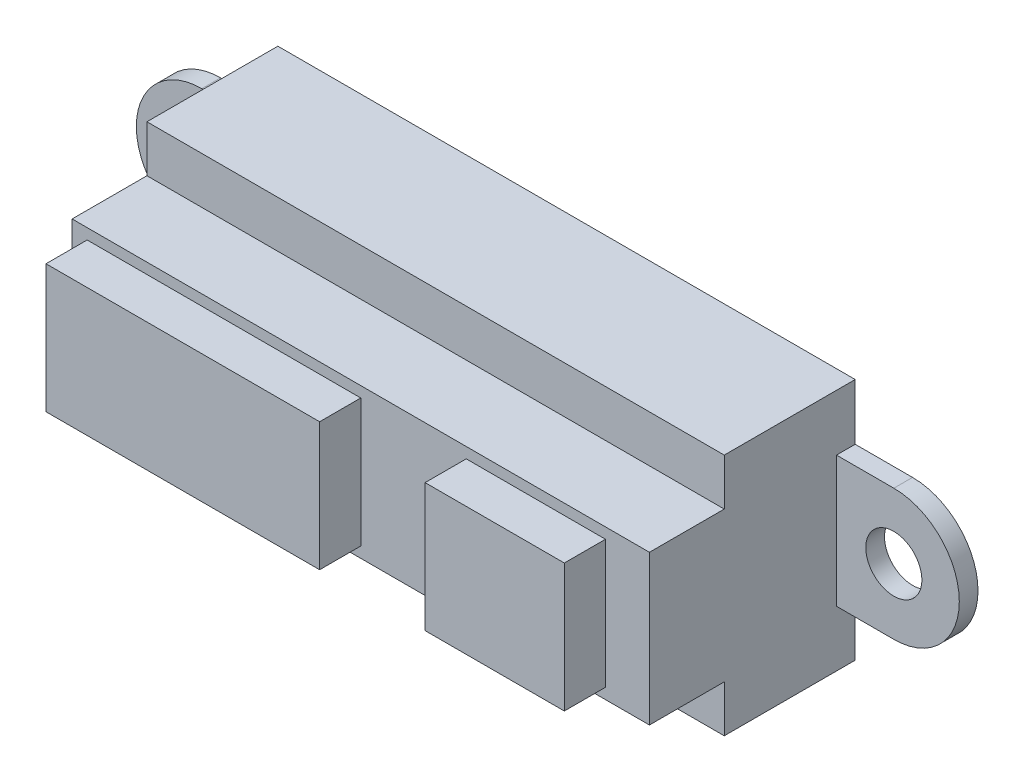
ISO-10303-21;
HEADER;
FILE_DESCRIPTION(('STEP AP214'),'2;1');
FILE_NAME('part.step','',(''),(''),'','','');
FILE_SCHEMA(('AUTOMOTIVE_DESIGN { 1 0 10303 214 1 1 1 1 }'));
ENDSEC;
DATA;
#1=APPLICATION_CONTEXT('core data for automotive mechanical design processes');
#2=APPLICATION_PROTOCOL_DEFINITION('international standard','automotive_design',2000,#1);
#3=PRODUCT_CONTEXT('',#1,'mechanical');
#4=PRODUCT('Part','Part','',(#3));
#5=PRODUCT_RELATED_PRODUCT_CATEGORY('part','',(#4));
#6=PRODUCT_DEFINITION_FORMATION('','',#4);
#7=PRODUCT_DEFINITION_CONTEXT('part definition',#1,'design');
#8=PRODUCT_DEFINITION('design','',#6,#7);
#9=PRODUCT_DEFINITION_SHAPE('','',#8);
#10=(LENGTH_UNIT() NAMED_UNIT(*) SI_UNIT(.MILLI.,.METRE.));
#11=(NAMED_UNIT(*) PLANE_ANGLE_UNIT() SI_UNIT($,.RADIAN.));
#12=(NAMED_UNIT(*) SI_UNIT($,.STERADIAN.) SOLID_ANGLE_UNIT());
#13=UNCERTAINTY_MEASURE_WITH_UNIT(LENGTH_MEASURE(1.E-05),#10,'distance_accuracy_value','');
#14=(GEOMETRIC_REPRESENTATION_CONTEXT(3) GLOBAL_UNCERTAINTY_ASSIGNED_CONTEXT((#13)) GLOBAL_UNIT_ASSIGNED_CONTEXT((#10,
#11,#12)) REPRESENTATION_CONTEXT('',''));
#15=CARTESIAN_POINT('',(0.,0.,0.));
#16=DIRECTION('',(0.,0.,1.));
#17=DIRECTION('',(1.,0.,0.));
#18=AXIS2_PLACEMENT_3D('',#15,#16,#17);
#19=CARTESIAN_POINT('',(0.,0.,11.));
#20=DIRECTION('',(0.,0.,1.));
#21=DIRECTION('',(1.,0.,0.));
#22=AXIS2_PLACEMENT_3D('',#19,#20,#21);
#23=PLANE('',#22);
#24=DIRECTION('',(0.,-1.,0.));
#25=VECTOR('',#24,1.);
#26=CARTESIAN_POINT('',(-15.4334998563258,4.,11.));
#27=LINE('',#26,#25);
#28=CARTESIAN_POINT('',(-15.4334998563258,4.,11.));
#29=VERTEX_POINT('',#28);
#30=CARTESIAN_POINT('',(-15.4334998563258,-4.,11.));
#31=VERTEX_POINT('',#30);
#32=EDGE_CURVE('E290',#29,#31,#27,.T.);
#33=ORIENTED_EDGE('',*,*,#32,.T.);
#34=DIRECTION('',(1.,0.,0.));
#35=VECTOR('',#34,1.);
#36=CARTESIAN_POINT('',(-15.4334998563258,-4.,11.));
#37=LINE('',#36,#35);
#38=CARTESIAN_POINT('',(15.4334998563258,-4.,11.));
#39=VERTEX_POINT('',#38);
#40=EDGE_CURVE('E293',#31,#39,#37,.T.);
#41=ORIENTED_EDGE('',*,*,#40,.T.);
#42=DIRECTION('',(0.,1.,0.));
#43=VECTOR('',#42,1.);
#44=CARTESIAN_POINT('',(15.4334998563258,4.,11.));
#45=LINE('',#44,#43);
#46=CARTESIAN_POINT('',(15.4334998563258,4.,11.));
#47=VERTEX_POINT('',#46);
#48=EDGE_CURVE('E295',#39,#47,#45,.T.);
#49=ORIENTED_EDGE('',*,*,#48,.T.);
#50=DIRECTION('',(-1.,0.,0.));
#51=VECTOR('',#50,1.);
#52=CARTESIAN_POINT('',(-15.4334998563258,4.,11.));
#53=LINE('',#52,#51);
#54=EDGE_CURVE('E297',#47,#29,#53,.T.);
#55=ORIENTED_EDGE('',*,*,#54,.T.);
#56=EDGE_LOOP('',(#33,#41,#49,#55));
#57=FACE_BOUND('',#56,.T.);
#58=DIRECTION('',(-1.,0.,0.));
#59=VECTOR('',#58,1.);
#60=CARTESIAN_POINT('',(0.,-3.42720985348212,11.));
#61=LINE('',#60,#59);
#62=CARTESIAN_POINT('',(0.,-3.42720985348212,11.));
#63=VERTEX_POINT('',#62);
#64=CARTESIAN_POINT('',(-14.6301323852945,-3.42720985348212,11.));
#65=VERTEX_POINT('',#64);
#66=EDGE_CURVE('E44',#63,#65,#61,.T.);
#67=ORIENTED_EDGE('',*,*,#66,.T.);
#68=DIRECTION('',(0.,1.,0.));
#69=VECTOR('',#68,1.);
#70=CARTESIAN_POINT('',(-14.6301323852945,0.,11.));
#71=LINE('',#70,#69);
#72=CARTESIAN_POINT('',(-14.6301323852945,3.42720985348204,11.));
#73=VERTEX_POINT('',#72);
#74=EDGE_CURVE('E11',#65,#73,#71,.T.);
#75=ORIENTED_EDGE('',*,*,#74,.T.);
#76=DIRECTION('',(1.,0.,0.));
#77=VECTOR('',#76,1.);
#78=CARTESIAN_POINT('',(0.,3.42720985348204,11.));
#79=LINE('',#78,#77);
#80=CARTESIAN_POINT('',(0.,3.42720985348204,11.));
#81=VERTEX_POINT('',#80);
#82=EDGE_CURVE('E378',#73,#81,#79,.T.);
#83=ORIENTED_EDGE('',*,*,#82,.T.);
#84=DIRECTION('',(0.,-1.,0.));
#85=VECTOR('',#84,1.);
#86=CARTESIAN_POINT('',(0.,0.,11.));
#87=LINE('',#86,#85);
#88=EDGE_CURVE('E381',#81,#63,#87,.T.);
#89=ORIENTED_EDGE('',*,*,#88,.T.);
#90=EDGE_LOOP('',(#67,#75,#83,#89));
#91=FACE_BOUND('',#90,.T.);
#92=DIRECTION('',(-1.,0.,0.));
#93=VECTOR('',#92,1.);
#94=CARTESIAN_POINT('',(0.,-3.42720985348212,11.));
#95=LINE('',#94,#93);
#96=CARTESIAN_POINT('',(13.0823601933993,-3.42720985348212,11.));
#97=VERTEX_POINT('',#96);
#98=CARTESIAN_POINT('',(5.63831298476084,-3.42720985348212,11.));
#99=VERTEX_POINT('',#98);
#100=EDGE_CURVE('E265',#97,#99,#95,.T.);
#101=ORIENTED_EDGE('',*,*,#100,.T.);
#102=DIRECTION('',(0.,1.,0.));
#103=VECTOR('',#102,1.);
#104=CARTESIAN_POINT('',(5.63831298476084,0.,11.));
#105=LINE('',#104,#103);
#106=CARTESIAN_POINT('',(5.63831298476084,3.42720985348204,11.));
#107=VERTEX_POINT('',#106);
#108=EDGE_CURVE('E268',#99,#107,#105,.T.);
#109=ORIENTED_EDGE('',*,*,#108,.T.);
#110=DIRECTION('',(1.,0.,0.));
#111=VECTOR('',#110,1.);
#112=CARTESIAN_POINT('',(0.,3.42720985348204,11.));
#113=LINE('',#112,#111);
#114=CARTESIAN_POINT('',(13.0823601933993,3.42720985348204,11.));
#115=VERTEX_POINT('',#114);
#116=EDGE_CURVE('E259',#107,#115,#113,.T.);
#117=ORIENTED_EDGE('',*,*,#116,.T.);
#118=DIRECTION('',(0.,-1.,0.));
#119=VECTOR('',#118,1.);
#120=CARTESIAN_POINT('',(13.0823601933993,0.,11.));
#121=LINE('',#120,#119);
#122=EDGE_CURVE('E262',#115,#97,#121,.T.);
#123=ORIENTED_EDGE('',*,*,#122,.T.);
#124=EDGE_LOOP('',(#101,#109,#117,#123));
#125=FACE_BOUND('',#124,.T.);
#126=ADVANCED_FACE('F35',(#57,#91,#125),#23,.T.);
#127=CARTESIAN_POINT('',(0.,0.,7.));
#128=DIRECTION('',(0.,0.,-1.));
#129=DIRECTION('',(-1.,0.,0.));
#130=AXIS2_PLACEMENT_3D('',#127,#128,#129);
#131=PLANE('',#130);
#132=DIRECTION('',(1.,0.,0.));
#133=VECTOR('',#132,1.);
#134=CARTESIAN_POINT('',(0.,-4.,7.));
#135=LINE('',#134,#133);
#136=CARTESIAN_POINT('',(-15.4334998563258,-4.,7.));
#137=VERTEX_POINT('',#136);
#138=CARTESIAN_POINT('',(15.4334998563258,-4.,7.));
#139=VERTEX_POINT('',#138);
#140=EDGE_CURVE('E375',#137,#139,#135,.T.);
#141=ORIENTED_EDGE('',*,*,#140,.F.);
#142=DIRECTION('',(0.,-1.,0.));
#143=VECTOR('',#142,1.);
#144=CARTESIAN_POINT('',(-15.4334998563258,6.5,7.));
#145=LINE('',#144,#143);
#146=CARTESIAN_POINT('',(-15.4334998563258,-6.5,7.));
#147=VERTEX_POINT('',#146);
#148=EDGE_CURVE('E315',#137,#147,#145,.T.);
#149=ORIENTED_EDGE('',*,*,#148,.T.);
#150=DIRECTION('',(1.,0.,0.));
#151=VECTOR('',#150,1.);
#152=CARTESIAN_POINT('',(-15.4334998563258,-6.5,7.));
#153=LINE('',#152,#151);
#154=CARTESIAN_POINT('',(15.4334998563258,-6.5,7.));
#155=VERTEX_POINT('',#154);
#156=EDGE_CURVE('E319',#147,#155,#153,.T.);
#157=ORIENTED_EDGE('',*,*,#156,.T.);
#158=DIRECTION('',(0.,1.,0.));
#159=VECTOR('',#158,1.);
#160=CARTESIAN_POINT('',(15.4334998563258,6.5,7.));
#161=LINE('',#160,#159);
#162=EDGE_CURVE('E322',#155,#139,#161,.T.);
#163=ORIENTED_EDGE('',*,*,#162,.T.);
#164=EDGE_LOOP('',(#141,#149,#157,#163));
#165=FACE_BOUND('',#164,.T.);
#166=ADVANCED_FACE('F461',(#165),#131,.F.);
#167=DIRECTION('',(-1.,0.,0.));
#168=VECTOR('',#167,1.);
#169=CARTESIAN_POINT('',(0.,4.,7.));
#170=LINE('',#169,#168);
#171=CARTESIAN_POINT('',(15.4334998563258,4.,7.));
#172=VERTEX_POINT('',#171);
#173=CARTESIAN_POINT('',(-15.4334998563258,4.,7.));
#174=VERTEX_POINT('',#173);
#175=EDGE_CURVE('E210',#172,#174,#170,.T.);
#176=ORIENTED_EDGE('',*,*,#175,.F.);
#177=CARTESIAN_POINT('',(15.4334998563258,6.5,7.));
#178=VERTEX_POINT('',#177);
#179=EDGE_CURVE('E321',#172,#178,#161,.T.);
#180=ORIENTED_EDGE('',*,*,#179,.T.);
#181=DIRECTION('',(-1.,0.,0.));
#182=VECTOR('',#181,1.);
#183=CARTESIAN_POINT('',(-15.4334998563258,6.5,7.));
#184=LINE('',#183,#182);
#185=CARTESIAN_POINT('',(-15.4334998563258,6.5,7.));
#186=VERTEX_POINT('',#185);
#187=EDGE_CURVE('E312',#178,#186,#184,.T.);
#188=ORIENTED_EDGE('',*,*,#187,.T.);
#189=EDGE_CURVE('E317',#186,#174,#145,.T.);
#190=ORIENTED_EDGE('',*,*,#189,.T.);
#191=EDGE_LOOP('',(#176,#180,#188,#190));
#192=FACE_BOUND('',#191,.T.);
#193=ADVANCED_FACE('F459',(#192),#131,.F.);
#194=CARTESIAN_POINT('',(-18.5,-3.5,1.));
#195=DIRECTION('',(0.,1.,0.));
#196=DIRECTION('',(0.,0.,1.));
#197=AXIS2_PLACEMENT_3D('',#194,#195,#196);
#198=PLANE('',#197);
#199=DIRECTION('',(0.,0.,-1.));
#200=VECTOR('',#199,1.);
#201=CARTESIAN_POINT('',(-15.4334998563258,-3.5,1.));
#202=LINE('',#201,#200);
#203=CARTESIAN_POINT('',(-15.4334998563258,-3.5,1.));
#204=VERTEX_POINT('',#203);
#205=CARTESIAN_POINT('',(-15.4334998563258,-3.49999999999999,0.));
#206=VERTEX_POINT('',#205);
#207=EDGE_CURVE('E356',#204,#206,#202,.T.);
#208=ORIENTED_EDGE('',*,*,#207,.F.);
#209=DIRECTION('',(1.,0.,0.));
#210=VECTOR('',#209,1.);
#211=CARTESIAN_POINT('',(-18.5,-3.5,1.));
#212=LINE('',#211,#210);
#213=CARTESIAN_POINT('',(-18.5,-3.5,1.));
#214=VERTEX_POINT('',#213);
#215=EDGE_CURVE('E205',#214,#204,#212,.T.);
#216=ORIENTED_EDGE('',*,*,#215,.F.);
#217=DIRECTION('',(0.,0.,-1.));
#218=VECTOR('',#217,1.);
#219=CARTESIAN_POINT('',(-18.5,-3.5,1.));
#220=LINE('',#219,#218);
#221=CARTESIAN_POINT('',(-18.5,-3.5,0.));
#222=VERTEX_POINT('',#221);
#223=EDGE_CURVE('E200',#214,#222,#220,.T.);
#224=ORIENTED_EDGE('',*,*,#223,.T.);
#225=DIRECTION('',(1.,0.,0.));
#226=VECTOR('',#225,1.);
#227=CARTESIAN_POINT('',(-18.5,-3.5,0.));
#228=LINE('',#227,#226);
#229=EDGE_CURVE('E203',#222,#206,#228,.T.);
#230=ORIENTED_EDGE('',*,*,#229,.T.);
#231=EDGE_LOOP('',(#208,#216,#224,#230));
#232=FACE_BOUND('',#231,.T.);
#233=ADVANCED_FACE('F37',(#232),#198,.F.);
#234=DIRECTION('',(0.,0.,1.));
#235=VECTOR('',#234,1.);
#236=CARTESIAN_POINT('',(15.4334998563258,-3.5,1.));
#237=LINE('',#236,#235);
#238=CARTESIAN_POINT('',(15.4334998563258,-3.49999999999999,0.));
#239=VERTEX_POINT('',#238);
#240=CARTESIAN_POINT('',(15.4334998563258,-3.5,1.));
#241=VERTEX_POINT('',#240);
#242=EDGE_CURVE('E348',#239,#241,#237,.T.);
#243=ORIENTED_EDGE('',*,*,#242,.F.);
#244=CARTESIAN_POINT('',(18.5,-3.5,0.));
#245=VERTEX_POINT('',#244);
#246=EDGE_CURVE('E222',#239,#245,#228,.T.);
#247=ORIENTED_EDGE('',*,*,#246,.T.);
#248=DIRECTION('',(0.,0.,-1.));
#249=VECTOR('',#248,1.);
#250=CARTESIAN_POINT('',(18.5,-3.5,1.));
#251=LINE('',#250,#249);
#252=CARTESIAN_POINT('',(18.5,-3.5,1.));
#253=VERTEX_POINT('',#252);
#254=EDGE_CURVE('E211',#253,#245,#251,.T.);
#255=ORIENTED_EDGE('',*,*,#254,.F.);
#256=EDGE_CURVE('E360',#241,#253,#212,.T.);
#257=ORIENTED_EDGE('',*,*,#256,.F.);
#258=EDGE_LOOP('',(#243,#247,#255,#257));
#259=FACE_BOUND('',#258,.T.);
#260=ADVANCED_FACE('F436',(#259),#198,.F.);
#261=CARTESIAN_POINT('',(-18.5,3.5,1.));
#262=DIRECTION('',(0.,-1.,0.));
#263=DIRECTION('',(0.,0.,-1.));
#264=AXIS2_PLACEMENT_3D('',#261,#262,#263);
#265=PLANE('',#264);
#266=DIRECTION('',(0.,0.,1.));
#267=VECTOR('',#266,1.);
#268=CARTESIAN_POINT('',(-15.4334998563258,3.5,1.));
#269=LINE('',#268,#267);
#270=CARTESIAN_POINT('',(-15.4334998563258,3.5,0.));
#271=VERTEX_POINT('',#270);
#272=CARTESIAN_POINT('',(-15.4334998563258,3.5,1.));
#273=VERTEX_POINT('',#272);
#274=EDGE_CURVE('E353',#271,#273,#269,.T.);
#275=ORIENTED_EDGE('',*,*,#274,.F.);
#276=DIRECTION('',(-1.,0.,0.));
#277=VECTOR('',#276,1.);
#278=CARTESIAN_POINT('',(-18.5,3.5,0.));
#279=LINE('',#278,#277);
#280=CARTESIAN_POINT('',(-18.5,3.5,0.));
#281=VERTEX_POINT('',#280);
#282=EDGE_CURVE('E221',#271,#281,#279,.T.);
#283=ORIENTED_EDGE('',*,*,#282,.T.);
#284=DIRECTION('',(0.,0.,-1.));
#285=VECTOR('',#284,1.);
#286=CARTESIAN_POINT('',(-18.5,3.5,1.));
#287=LINE('',#286,#285);
#288=CARTESIAN_POINT('',(-18.5,3.5,1.));
#289=VERTEX_POINT('',#288);
#290=EDGE_CURVE('E227',#289,#281,#287,.T.);
#291=ORIENTED_EDGE('',*,*,#290,.F.);
#292=DIRECTION('',(-1.,0.,0.));
#293=VECTOR('',#292,1.);
#294=CARTESIAN_POINT('',(-18.5,3.5,1.));
#295=LINE('',#294,#293);
#296=EDGE_CURVE('E359',#273,#289,#295,.T.);
#297=ORIENTED_EDGE('',*,*,#296,.F.);
#298=EDGE_LOOP('',(#275,#283,#291,#297));
#299=FACE_BOUND('',#298,.T.);
#300=ADVANCED_FACE('F412',(#299),#265,.F.);
#301=DIRECTION('',(0.,0.,-1.));
#302=VECTOR('',#301,1.);
#303=CARTESIAN_POINT('',(15.4334998563258,3.5,1.));
#304=LINE('',#303,#302);
#305=CARTESIAN_POINT('',(15.4334998563258,3.5,1.));
#306=VERTEX_POINT('',#305);
#307=CARTESIAN_POINT('',(15.4334998563258,3.5,0.));
#308=VERTEX_POINT('',#307);
#309=EDGE_CURVE('E346',#306,#308,#304,.T.);
#310=ORIENTED_EDGE('',*,*,#309,.F.);
#311=CARTESIAN_POINT('',(18.5,3.5,1.));
#312=VERTEX_POINT('',#311);
#313=EDGE_CURVE('E361',#312,#306,#295,.T.);
#314=ORIENTED_EDGE('',*,*,#313,.F.);
#315=DIRECTION('',(0.,0.,-1.));
#316=VECTOR('',#315,1.);
#317=CARTESIAN_POINT('',(18.5,3.5,1.));
#318=LINE('',#317,#316);
#319=CARTESIAN_POINT('',(18.5,3.5,0.));
#320=VERTEX_POINT('',#319);
#321=EDGE_CURVE('E368',#312,#320,#318,.T.);
#322=ORIENTED_EDGE('',*,*,#321,.T.);
#323=EDGE_CURVE('E364',#320,#308,#279,.T.);
#324=ORIENTED_EDGE('',*,*,#323,.T.);
#325=EDGE_LOOP('',(#310,#314,#322,#324));
#326=FACE_BOUND('',#325,.T.);
#327=ADVANCED_FACE('F405',(#326),#265,.F.);
#328=CARTESIAN_POINT('',(0.,0.,1.));
#329=DIRECTION('',(0.,0.,1.));
#330=DIRECTION('',(1.,0.,0.));
#331=AXIS2_PLACEMENT_3D('',#328,#329,#330);
#332=PLANE('',#331);
#333=CARTESIAN_POINT('',(-18.5,0.,1.));
#334=DIRECTION('',(0.,0.,1.));
#335=DIRECTION('',(1.,0.,0.));
#336=AXIS2_PLACEMENT_3D('',#333,#334,#335);
#337=CIRCLE('',#336,1.5);
#338=CARTESIAN_POINT('',(-17.,0.,1.));
#339=VERTEX_POINT('',#338);
#340=EDGE_CURVE('E393',#339,#339,#337,.T.);
#341=ORIENTED_EDGE('',*,*,#340,.F.);
#342=EDGE_LOOP('',(#341));
#343=FACE_BOUND('',#342,.T.);
#344=DIRECTION('',(0.,1.,0.));
#345=VECTOR('',#344,1.);
#346=CARTESIAN_POINT('',(-15.4334998563258,0.,1.));
#347=LINE('',#346,#345);
#348=EDGE_CURVE('E351',#204,#273,#347,.T.);
#349=ORIENTED_EDGE('',*,*,#348,.T.);
#350=ORIENTED_EDGE('',*,*,#296,.T.);
#351=CARTESIAN_POINT('',(-18.5,0.,1.));
#352=DIRECTION('',(0.,0.,1.));
#353=DIRECTION('',(1.,0.,0.));
#354=AXIS2_PLACEMENT_3D('',#351,#352,#353);
#355=CIRCLE('',#354,3.5);
#356=EDGE_CURVE('E229',#289,#214,#355,.T.);
#357=ORIENTED_EDGE('',*,*,#356,.T.);
#358=ORIENTED_EDGE('',*,*,#215,.T.);
#359=EDGE_LOOP('',(#349,#350,#357,#358));
#360=FACE_BOUND('',#359,.T.);
#361=ADVANCED_FACE('F401',(#343,#360),#332,.T.);
#362=CARTESIAN_POINT('',(18.5,0.,1.));
#363=DIRECTION('',(0.,0.,1.));
#364=DIRECTION('',(1.,0.,0.));
#365=AXIS2_PLACEMENT_3D('',#362,#363,#364);
#366=CIRCLE('',#365,1.5);
#367=CARTESIAN_POINT('',(20.,0.,1.));
#368=VERTEX_POINT('',#367);
#369=EDGE_CURVE('E386',#368,#368,#366,.T.);
#370=ORIENTED_EDGE('',*,*,#369,.F.);
#371=EDGE_LOOP('',(#370));
#372=FACE_BOUND('',#371,.T.);
#373=ORIENTED_EDGE('',*,*,#256,.T.);
#374=CARTESIAN_POINT('',(18.5,0.,1.));
#375=DIRECTION('',(0.,0.,1.));
#376=DIRECTION('',(1.,0.,0.));
#377=AXIS2_PLACEMENT_3D('',#374,#375,#376);
#378=CIRCLE('',#377,3.5);
#379=EDGE_CURVE('E228',#253,#312,#378,.T.);
#380=ORIENTED_EDGE('',*,*,#379,.T.);
#381=ORIENTED_EDGE('',*,*,#313,.T.);
#382=DIRECTION('',(0.,-1.,0.));
#383=VECTOR('',#382,1.);
#384=CARTESIAN_POINT('',(15.4334998563258,0.,1.));
#385=LINE('',#384,#383);
#386=EDGE_CURVE('E344',#306,#241,#385,.T.);
#387=ORIENTED_EDGE('',*,*,#386,.T.);
#388=EDGE_LOOP('',(#373,#380,#381,#387));
#389=FACE_BOUND('',#388,.T.);
#390=ADVANCED_FACE('F404',(#372,#389),#332,.T.);
#391=CARTESIAN_POINT('',(0.,0.,0.));
#392=DIRECTION('',(0.,0.,1.));
#393=DIRECTION('',(1.,0.,0.));
#394=AXIS2_PLACEMENT_3D('',#391,#392,#393);
#395=PLANE('',#394);
#396=CARTESIAN_POINT('',(-18.5,0.,0.));
#397=DIRECTION('',(0.,0.,1.));
#398=DIRECTION('',(1.,0.,0.));
#399=AXIS2_PLACEMENT_3D('',#396,#397,#398);
#400=CIRCLE('',#399,1.5);
#401=CARTESIAN_POINT('',(-17.,0.,0.));
#402=VERTEX_POINT('',#401);
#403=EDGE_CURVE('E39',#402,#402,#400,.T.);
#404=ORIENTED_EDGE('',*,*,#403,.T.);
#405=EDGE_LOOP('',(#404));
#406=FACE_BOUND('',#405,.T.);
#407=CARTESIAN_POINT('',(18.5,0.,0.));
#408=DIRECTION('',(0.,0.,1.));
#409=DIRECTION('',(1.,0.,0.));
#410=AXIS2_PLACEMENT_3D('',#407,#408,#409);
#411=CIRCLE('',#410,1.5);
#412=CARTESIAN_POINT('',(20.,0.,0.));
#413=VERTEX_POINT('',#412);
#414=EDGE_CURVE('E234',#413,#413,#411,.T.);
#415=ORIENTED_EDGE('',*,*,#414,.T.);
#416=EDGE_LOOP('',(#415));
#417=FACE_BOUND('',#416,.T.);
#418=ORIENTED_EDGE('',*,*,#229,.F.);
#419=CARTESIAN_POINT('',(-18.5,0.,0.));
#420=DIRECTION('',(0.,0.,1.));
#421=DIRECTION('',(1.,0.,0.));
#422=AXIS2_PLACEMENT_3D('',#419,#420,#421);
#423=CIRCLE('',#422,3.5);
#424=EDGE_CURVE('E218',#222,#281,#423,.F.);
#425=ORIENTED_EDGE('',*,*,#424,.T.);
#426=ORIENTED_EDGE('',*,*,#282,.F.);
#427=DIRECTION('',(0.,-1.,0.));
#428=VECTOR('',#427,1.);
#429=CARTESIAN_POINT('',(-15.4334998563258,6.5,0.));
#430=LINE('',#429,#428);
#431=CARTESIAN_POINT('',(-15.4334998563258,6.5,0.));
#432=VERTEX_POINT('',#431);
#433=EDGE_CURVE('E327',#432,#271,#430,.T.);
#434=ORIENTED_EDGE('',*,*,#433,.F.);
#435=DIRECTION('',(-1.,0.,0.));
#436=VECTOR('',#435,1.);
#437=CARTESIAN_POINT('',(-15.4334998563258,6.5,0.));
#438=LINE('',#437,#436);
#439=CARTESIAN_POINT('',(15.4334998563258,6.5,0.));
#440=VERTEX_POINT('',#439);
#441=EDGE_CURVE('E311',#440,#432,#438,.T.);
#442=ORIENTED_EDGE('',*,*,#441,.F.);
#443=DIRECTION('',(0.,1.,0.));
#444=VECTOR('',#443,1.);
#445=CARTESIAN_POINT('',(15.4334998563258,6.5,0.));
#446=LINE('',#445,#444);
#447=EDGE_CURVE('E331',#308,#440,#446,.T.);
#448=ORIENTED_EDGE('',*,*,#447,.F.);
#449=ORIENTED_EDGE('',*,*,#323,.F.);
#450=CARTESIAN_POINT('',(18.5,0.,0.));
#451=DIRECTION('',(0.,0.,1.));
#452=DIRECTION('',(1.,0.,0.));
#453=AXIS2_PLACEMENT_3D('',#450,#451,#452);
#454=CIRCLE('',#453,3.5);
#455=EDGE_CURVE('E232',#320,#245,#454,.F.);
#456=ORIENTED_EDGE('',*,*,#455,.T.);
#457=ORIENTED_EDGE('',*,*,#246,.F.);
#458=CARTESIAN_POINT('',(15.4334998563258,-6.5,0.));
#459=VERTEX_POINT('',#458);
#460=EDGE_CURVE('E316',#459,#239,#446,.T.);
#461=ORIENTED_EDGE('',*,*,#460,.F.);
#462=DIRECTION('',(1.,0.,0.));
#463=VECTOR('',#462,1.);
#464=CARTESIAN_POINT('',(-15.4334998563258,-6.5,0.));
#465=LINE('',#464,#463);
#466=CARTESIAN_POINT('',(-15.4334998563258,-6.5,0.));
#467=VERTEX_POINT('',#466);
#468=EDGE_CURVE('E329',#467,#459,#465,.T.);
#469=ORIENTED_EDGE('',*,*,#468,.F.);
#470=EDGE_CURVE('E220',#206,#467,#430,.T.);
#471=ORIENTED_EDGE('',*,*,#470,.F.);
#472=EDGE_LOOP('',(#418,#425,#426,#434,#442,#448,#449,#456,#457,#461,#469,#471));
#473=FACE_BOUND('',#472,.T.);
#474=ADVANCED_FACE('F216',(#406,#417,#473),#395,.F.);
#475=CARTESIAN_POINT('',(-15.4334998563258,6.5,7.));
#476=DIRECTION('',(1.,0.,0.));
#477=DIRECTION('',(0.,0.,-1.));
#478=AXIS2_PLACEMENT_3D('',#475,#476,#477);
#479=PLANE('',#478);
#480=ORIENTED_EDGE('',*,*,#470,.T.);
#481=DIRECTION('',(0.,0.,-1.));
#482=VECTOR('',#481,1.);
#483=CARTESIAN_POINT('',(-15.4334998563258,-6.5,7.));
#484=LINE('',#483,#482);
#485=EDGE_CURVE('E338',#147,#467,#484,.T.);
#486=ORIENTED_EDGE('',*,*,#485,.F.);
#487=ORIENTED_EDGE('',*,*,#148,.F.);
#488=DIRECTION('',(0.,0.,-1.));
#489=VECTOR('',#488,1.);
#490=CARTESIAN_POINT('',(-15.4334998563258,-4.,11.));
#491=LINE('',#490,#489);
#492=EDGE_CURVE('E308',#31,#137,#491,.T.);
#493=ORIENTED_EDGE('',*,*,#492,.F.);
#494=ORIENTED_EDGE('',*,*,#32,.F.);
#495=DIRECTION('',(0.,0.,-1.));
#496=VECTOR('',#495,1.);
#497=CARTESIAN_POINT('',(-15.4334998563258,4.,11.));
#498=LINE('',#497,#496);
#499=EDGE_CURVE('E299',#29,#174,#498,.T.);
#500=ORIENTED_EDGE('',*,*,#499,.T.);
#501=ORIENTED_EDGE('',*,*,#189,.F.);
#502=DIRECTION('',(0.,0.,-1.));
#503=VECTOR('',#502,1.);
#504=CARTESIAN_POINT('',(-15.4334998563258,6.5,7.));
#505=LINE('',#504,#503);
#506=EDGE_CURVE('E341',#186,#432,#505,.T.);
#507=ORIENTED_EDGE('',*,*,#506,.T.);
#508=ORIENTED_EDGE('',*,*,#433,.T.);
#509=ORIENTED_EDGE('',*,*,#274,.T.);
#510=ORIENTED_EDGE('',*,*,#348,.F.);
#511=ORIENTED_EDGE('',*,*,#207,.T.);
#512=EDGE_LOOP('',(#480,#486,#487,#493,#494,#500,#501,#507,#508,#509,#510,#511));
#513=FACE_BOUND('',#512,.T.);
#514=ADVANCED_FACE('F410',(#513),#479,.F.);
#515=CARTESIAN_POINT('',(15.4334998563258,6.5,7.));
#516=DIRECTION('',(-1.,0.,0.));
#517=DIRECTION('',(0.,0.,1.));
#518=AXIS2_PLACEMENT_3D('',#515,#516,#517);
#519=PLANE('',#518);
#520=ORIENTED_EDGE('',*,*,#447,.T.);
#521=DIRECTION('',(0.,0.,-1.));
#522=VECTOR('',#521,1.);
#523=CARTESIAN_POINT('',(15.4334998563258,6.5,7.));
#524=LINE('',#523,#522);
#525=EDGE_CURVE('E324',#178,#440,#524,.T.);
#526=ORIENTED_EDGE('',*,*,#525,.F.);
#527=ORIENTED_EDGE('',*,*,#179,.F.);
#528=DIRECTION('',(0.,0.,-1.));
#529=VECTOR('',#528,1.);
#530=CARTESIAN_POINT('',(15.4334998563258,4.,11.));
#531=LINE('',#530,#529);
#532=EDGE_CURVE('E302',#47,#172,#531,.T.);
#533=ORIENTED_EDGE('',*,*,#532,.F.);
#534=ORIENTED_EDGE('',*,*,#48,.F.);
#535=DIRECTION('',(0.,0.,-1.));
#536=VECTOR('',#535,1.);
#537=CARTESIAN_POINT('',(15.4334998563258,-4.,11.));
#538=LINE('',#537,#536);
#539=EDGE_CURVE('E305',#39,#139,#538,.T.);
#540=ORIENTED_EDGE('',*,*,#539,.T.);
#541=ORIENTED_EDGE('',*,*,#162,.F.);
#542=DIRECTION('',(0.,0.,-1.));
#543=VECTOR('',#542,1.);
#544=CARTESIAN_POINT('',(15.4334998563258,-6.5,7.));
#545=LINE('',#544,#543);
#546=EDGE_CURVE('E335',#155,#459,#545,.T.);
#547=ORIENTED_EDGE('',*,*,#546,.T.);
#548=ORIENTED_EDGE('',*,*,#460,.T.);
#549=ORIENTED_EDGE('',*,*,#242,.T.);
#550=ORIENTED_EDGE('',*,*,#386,.F.);
#551=ORIENTED_EDGE('',*,*,#309,.T.);
#552=EDGE_LOOP('',(#520,#526,#527,#533,#534,#540,#541,#547,#548,#549,#550,#551));
#553=FACE_BOUND('',#552,.T.);
#554=ADVANCED_FACE('F422',(#553),#519,.F.);
#555=CARTESIAN_POINT('',(-15.4334998563258,6.5,7.));
#556=DIRECTION('',(0.,-1.,0.));
#557=DIRECTION('',(1.,0.,0.));
#558=AXIS2_PLACEMENT_3D('',#555,#556,#557);
#559=PLANE('',#558);
#560=ORIENTED_EDGE('',*,*,#441,.T.);
#561=ORIENTED_EDGE('',*,*,#506,.F.);
#562=ORIENTED_EDGE('',*,*,#187,.F.);
#563=ORIENTED_EDGE('',*,*,#525,.T.);
#564=EDGE_LOOP('',(#560,#561,#562,#563));
#565=FACE_BOUND('',#564,.T.);
#566=ADVANCED_FACE('F418',(#565),#559,.F.);
#567=CARTESIAN_POINT('',(-15.4334998563258,-6.5,7.));
#568=DIRECTION('',(0.,1.,0.));
#569=DIRECTION('',(-1.,0.,0.));
#570=AXIS2_PLACEMENT_3D('',#567,#568,#569);
#571=PLANE('',#570);
#572=ORIENTED_EDGE('',*,*,#468,.T.);
#573=ORIENTED_EDGE('',*,*,#546,.F.);
#574=ORIENTED_EDGE('',*,*,#156,.F.);
#575=ORIENTED_EDGE('',*,*,#485,.T.);
#576=EDGE_LOOP('',(#572,#573,#574,#575));
#577=FACE_BOUND('',#576,.T.);
#578=ADVANCED_FACE('F442',(#577),#571,.F.);
#579=CARTESIAN_POINT('',(-15.4334998563258,-4.,11.));
#580=DIRECTION('',(0.,1.,0.));
#581=DIRECTION('',(0.,0.,1.));
#582=AXIS2_PLACEMENT_3D('',#579,#580,#581);
#583=PLANE('',#582);
#584=ORIENTED_EDGE('',*,*,#492,.T.);
#585=ORIENTED_EDGE('',*,*,#140,.T.);
#586=ORIENTED_EDGE('',*,*,#539,.F.);
#587=ORIENTED_EDGE('',*,*,#40,.F.);
#588=EDGE_LOOP('',(#584,#585,#586,#587));
#589=FACE_BOUND('',#588,.T.);
#590=ADVANCED_FACE('F449',(#589),#583,.F.);
#591=CARTESIAN_POINT('',(-15.4334998563258,4.,11.));
#592=DIRECTION('',(0.,-1.,0.));
#593=DIRECTION('',(0.,0.,-1.));
#594=AXIS2_PLACEMENT_3D('',#591,#592,#593);
#595=PLANE('',#594);
#596=ORIENTED_EDGE('',*,*,#532,.T.);
#597=ORIENTED_EDGE('',*,*,#175,.T.);
#598=ORIENTED_EDGE('',*,*,#499,.F.);
#599=ORIENTED_EDGE('',*,*,#54,.F.);
#600=EDGE_LOOP('',(#596,#597,#598,#599));
#601=FACE_BOUND('',#600,.T.);
#602=ADVANCED_FACE('F457',(#601),#595,.F.);
#603=CARTESIAN_POINT('',(-14.6301323852945,3.42720985348204,13.2));
#604=DIRECTION('',(1.,0.,0.));
#605=DIRECTION('',(0.,0.,-1.));
#606=AXIS2_PLACEMENT_3D('',#603,#604,#605);
#607=PLANE('',#606);
#608=ORIENTED_EDGE('',*,*,#74,.F.);
#609=DIRECTION('',(0.,0.,-1.));
#610=VECTOR('',#609,1.);
#611=CARTESIAN_POINT('',(-14.6301323852945,-3.42720985348212,13.2));
#612=LINE('',#611,#610);
#613=CARTESIAN_POINT('',(-14.6301323852945,-3.42720985348212,13.2));
#614=VERTEX_POINT('',#613);
#615=EDGE_CURVE('E287',#614,#65,#612,.T.);
#616=ORIENTED_EDGE('',*,*,#615,.F.);
#617=DIRECTION('',(0.,-1.,0.));
#618=VECTOR('',#617,1.);
#619=CARTESIAN_POINT('',(-14.6301323852945,3.42720985348204,13.2));
#620=LINE('',#619,#618);
#621=CARTESIAN_POINT('',(-14.6301323852945,3.42720985348204,13.2));
#622=VERTEX_POINT('',#621);
#623=EDGE_CURVE('E271',#622,#614,#620,.T.);
#624=ORIENTED_EDGE('',*,*,#623,.F.);
#625=DIRECTION('',(0.,0.,-1.));
#626=VECTOR('',#625,1.);
#627=CARTESIAN_POINT('',(-14.6301323852945,3.42720985348204,13.2));
#628=LINE('',#627,#626);
#629=EDGE_CURVE('E280',#622,#73,#628,.T.);
#630=ORIENTED_EDGE('',*,*,#629,.T.);
#631=EDGE_LOOP('',(#608,#616,#624,#630));
#632=FACE_BOUND('',#631,.T.);
#633=ADVANCED_FACE('F475',(#632),#607,.F.);
#634=CARTESIAN_POINT('',(-14.6301323852945,-3.42720985348212,13.2));
#635=DIRECTION('',(0.,1.,0.));
#636=DIRECTION('',(0.,0.,1.));
#637=AXIS2_PLACEMENT_3D('',#634,#635,#636);
#638=PLANE('',#637);
#639=ORIENTED_EDGE('',*,*,#66,.F.);
#640=DIRECTION('',(0.,0.,-1.));
#641=VECTOR('',#640,1.);
#642=CARTESIAN_POINT('',(0.,-3.42720985348212,13.2));
#643=LINE('',#642,#641);
#644=CARTESIAN_POINT('',(0.,-3.42720985348212,13.2));
#645=VERTEX_POINT('',#644);
#646=EDGE_CURVE('E284',#645,#63,#643,.T.);
#647=ORIENTED_EDGE('',*,*,#646,.F.);
#648=DIRECTION('',(1.,0.,0.));
#649=VECTOR('',#648,1.);
#650=CARTESIAN_POINT('',(-14.6301323852945,-3.42720985348212,13.2));
#651=LINE('',#650,#649);
#652=EDGE_CURVE('E274',#614,#645,#651,.T.);
#653=ORIENTED_EDGE('',*,*,#652,.F.);
#654=ORIENTED_EDGE('',*,*,#615,.T.);
#655=EDGE_LOOP('',(#639,#647,#653,#654));
#656=FACE_BOUND('',#655,.T.);
#657=ADVANCED_FACE('F584',(#656),#638,.F.);
#658=CARTESIAN_POINT('',(0.,3.42720985348204,13.2));
#659=DIRECTION('',(-1.,0.,0.));
#660=DIRECTION('',(0.,0.,1.));
#661=AXIS2_PLACEMENT_3D('',#658,#659,#660);
#662=PLANE('',#661);
#663=ORIENTED_EDGE('',*,*,#88,.F.);
#664=DIRECTION('',(0.,0.,-1.));
#665=VECTOR('',#664,1.);
#666=CARTESIAN_POINT('',(0.,3.42720985348204,13.2));
#667=LINE('',#666,#665);
#668=CARTESIAN_POINT('',(0.,3.42720985348204,13.2));
#669=VERTEX_POINT('',#668);
#670=EDGE_CURVE('E60',#669,#81,#667,.T.);
#671=ORIENTED_EDGE('',*,*,#670,.F.);
#672=DIRECTION('',(0.,1.,0.));
#673=VECTOR('',#672,1.);
#674=CARTESIAN_POINT('',(0.,3.42720985348204,13.2));
#675=LINE('',#674,#673);
#676=EDGE_CURVE('E276',#645,#669,#675,.T.);
#677=ORIENTED_EDGE('',*,*,#676,.F.);
#678=ORIENTED_EDGE('',*,*,#646,.T.);
#679=EDGE_LOOP('',(#663,#671,#677,#678));
#680=FACE_BOUND('',#679,.T.);
#681=ADVANCED_FACE('F575',(#680),#662,.F.);
#682=CARTESIAN_POINT('',(-14.6301323852945,3.42720985348204,13.2));
#683=DIRECTION('',(0.,-1.,0.));
#684=DIRECTION('',(0.,0.,-1.));
#685=AXIS2_PLACEMENT_3D('',#682,#683,#684);
#686=PLANE('',#685);
#687=ORIENTED_EDGE('',*,*,#82,.F.);
#688=ORIENTED_EDGE('',*,*,#629,.F.);
#689=DIRECTION('',(-1.,0.,0.));
#690=VECTOR('',#689,1.);
#691=CARTESIAN_POINT('',(-14.6301323852945,3.42720985348204,13.2));
#692=LINE('',#691,#690);
#693=EDGE_CURVE('E278',#669,#622,#692,.T.);
#694=ORIENTED_EDGE('',*,*,#693,.F.);
#695=ORIENTED_EDGE('',*,*,#670,.T.);
#696=EDGE_LOOP('',(#687,#688,#694,#695));
#697=FACE_BOUND('',#696,.T.);
#698=ADVANCED_FACE('F565',(#697),#686,.F.);
#699=CARTESIAN_POINT('',(0.,0.,13.2));
#700=DIRECTION('',(0.,0.,1.));
#701=DIRECTION('',(1.,0.,0.));
#702=AXIS2_PLACEMENT_3D('',#699,#700,#701);
#703=PLANE('',#702);
#704=ORIENTED_EDGE('',*,*,#623,.T.);
#705=ORIENTED_EDGE('',*,*,#652,.T.);
#706=ORIENTED_EDGE('',*,*,#676,.T.);
#707=ORIENTED_EDGE('',*,*,#693,.T.);
#708=EDGE_LOOP('',(#704,#705,#706,#707));
#709=FACE_BOUND('',#708,.T.);
#710=ADVANCED_FACE('F555',(#709),#703,.T.);
#711=CARTESIAN_POINT('',(5.63831298476084,3.42720985348204,13.2));
#712=DIRECTION('',(1.,0.,0.));
#713=DIRECTION('',(0.,1.,0.));
#714=AXIS2_PLACEMENT_3D('',#711,#712,#713);
#715=PLANE('',#714);
#716=ORIENTED_EDGE('',*,*,#108,.F.);
#717=DIRECTION('',(0.,0.,-1.));
#718=VECTOR('',#717,1.);
#719=CARTESIAN_POINT('',(5.63831298476084,-3.42720985348212,13.2));
#720=LINE('',#719,#718);
#721=CARTESIAN_POINT('',(5.63831298476084,-3.42720985348212,13.2));
#722=VERTEX_POINT('',#721);
#723=EDGE_CURVE('E256',#722,#99,#720,.T.);
#724=ORIENTED_EDGE('',*,*,#723,.F.);
#725=DIRECTION('',(0.,-1.,0.));
#726=VECTOR('',#725,1.);
#727=CARTESIAN_POINT('',(5.63831298476084,3.42720985348204,13.2));
#728=LINE('',#727,#726);
#729=CARTESIAN_POINT('',(5.63831298476084,3.42720985348204,13.2));
#730=VERTEX_POINT('',#729);
#731=EDGE_CURVE('E240',#730,#722,#728,.T.);
#732=ORIENTED_EDGE('',*,*,#731,.F.);
#733=DIRECTION('',(0.,0.,-1.));
#734=VECTOR('',#733,1.);
#735=CARTESIAN_POINT('',(5.63831298476084,3.42720985348204,13.2));
#736=LINE('',#735,#734);
#737=EDGE_CURVE('E249',#730,#107,#736,.T.);
#738=ORIENTED_EDGE('',*,*,#737,.T.);
#739=EDGE_LOOP('',(#716,#724,#732,#738));
#740=FACE_BOUND('',#739,.T.);
#741=ADVANCED_FACE('F545',(#740),#715,.F.);
#742=CARTESIAN_POINT('',(5.63831298476084,-3.42720985348212,13.2));
#743=DIRECTION('',(0.,1.,0.));
#744=DIRECTION('',(0.,0.,1.));
#745=AXIS2_PLACEMENT_3D('',#742,#743,#744);
#746=PLANE('',#745);
#747=ORIENTED_EDGE('',*,*,#100,.F.);
#748=DIRECTION('',(0.,0.,-1.));
#749=VECTOR('',#748,1.);
#750=CARTESIAN_POINT('',(13.0823601933993,-3.42720985348212,13.2));
#751=LINE('',#750,#749);
#752=CARTESIAN_POINT('',(13.0823601933993,-3.42720985348212,13.2));
#753=VERTEX_POINT('',#752);
#754=EDGE_CURVE('E253',#753,#97,#751,.T.);
#755=ORIENTED_EDGE('',*,*,#754,.F.);
#756=DIRECTION('',(1.,0.,0.));
#757=VECTOR('',#756,1.);
#758=CARTESIAN_POINT('',(5.63831298476084,-3.42720985348212,13.2));
#759=LINE('',#758,#757);
#760=EDGE_CURVE('E243',#722,#753,#759,.T.);
#761=ORIENTED_EDGE('',*,*,#760,.F.);
#762=ORIENTED_EDGE('',*,*,#723,.T.);
#763=EDGE_LOOP('',(#747,#755,#761,#762));
#764=FACE_BOUND('',#763,.T.);
#765=ADVANCED_FACE('F535',(#764),#746,.F.);
#766=CARTESIAN_POINT('',(13.0823601933993,3.42720985348204,13.2));
#767=DIRECTION('',(-1.,0.,0.));
#768=DIRECTION('',(0.,0.,1.));
#769=AXIS2_PLACEMENT_3D('',#766,#767,#768);
#770=PLANE('',#769);
#771=ORIENTED_EDGE('',*,*,#122,.F.);
#772=DIRECTION('',(0.,0.,-1.));
#773=VECTOR('',#772,1.);
#774=CARTESIAN_POINT('',(13.0823601933993,3.42720985348204,13.2));
#775=LINE('',#774,#773);
#776=CARTESIAN_POINT('',(13.0823601933993,3.42720985348204,13.2));
#777=VERTEX_POINT('',#776);
#778=EDGE_CURVE('E52',#777,#115,#775,.T.);
#779=ORIENTED_EDGE('',*,*,#778,.F.);
#780=DIRECTION('',(0.,1.,0.));
#781=VECTOR('',#780,1.);
#782=CARTESIAN_POINT('',(13.0823601933993,3.42720985348204,13.2));
#783=LINE('',#782,#781);
#784=EDGE_CURVE('E245',#753,#777,#783,.T.);
#785=ORIENTED_EDGE('',*,*,#784,.F.);
#786=ORIENTED_EDGE('',*,*,#754,.T.);
#787=EDGE_LOOP('',(#771,#779,#785,#786));
#788=FACE_BOUND('',#787,.T.);
#789=ADVANCED_FACE('F526',(#788),#770,.F.);
#790=CARTESIAN_POINT('',(5.63831298476084,3.42720985348204,13.2));
#791=DIRECTION('',(0.,-1.,0.));
#792=DIRECTION('',(0.,0.,-1.));
#793=AXIS2_PLACEMENT_3D('',#790,#791,#792);
#794=PLANE('',#793);
#795=ORIENTED_EDGE('',*,*,#116,.F.);
#796=ORIENTED_EDGE('',*,*,#737,.F.);
#797=DIRECTION('',(-1.,0.,0.));
#798=VECTOR('',#797,1.);
#799=CARTESIAN_POINT('',(5.63831298476084,3.42720985348204,13.2));
#800=LINE('',#799,#798);
#801=EDGE_CURVE('E247',#777,#730,#800,.T.);
#802=ORIENTED_EDGE('',*,*,#801,.F.);
#803=ORIENTED_EDGE('',*,*,#778,.T.);
#804=EDGE_LOOP('',(#795,#796,#802,#803));
#805=FACE_BOUND('',#804,.T.);
#806=ADVANCED_FACE('F514',(#805),#794,.F.);
#807=CARTESIAN_POINT('',(0.,0.,13.2));
#808=DIRECTION('',(0.,0.,1.));
#809=DIRECTION('',(1.,0.,0.));
#810=AXIS2_PLACEMENT_3D('',#807,#808,#809);
#811=PLANE('',#810);
#812=ORIENTED_EDGE('',*,*,#731,.T.);
#813=ORIENTED_EDGE('',*,*,#760,.T.);
#814=ORIENTED_EDGE('',*,*,#784,.T.);
#815=ORIENTED_EDGE('',*,*,#801,.T.);
#816=EDGE_LOOP('',(#812,#813,#814,#815));
#817=FACE_BOUND('',#816,.T.);
#818=ADVANCED_FACE('F509',(#817),#811,.T.);
#819=CARTESIAN_POINT('',(18.5,0.,-9.89949493661167));
#820=DIRECTION('',(0.,0.,1.));
#821=DIRECTION('',(1.,0.,0.));
#822=AXIS2_PLACEMENT_3D('',#819,#820,#821);
#823=CYLINDRICAL_SURFACE('',#822,3.5);
#824=ORIENTED_EDGE('',*,*,#254,.T.);
#825=ORIENTED_EDGE('',*,*,#455,.F.);
#826=ORIENTED_EDGE('',*,*,#321,.F.);
#827=ORIENTED_EDGE('',*,*,#379,.F.);
#828=EDGE_LOOP('',(#824,#825,#826,#827));
#829=FACE_BOUND('',#828,.T.);
#830=ADVANCED_FACE('F430',(#829),#823,.T.);
#831=CARTESIAN_POINT('',(-18.5,0.,-9.89949493661167));
#832=DIRECTION('',(0.,0.,1.));
#833=DIRECTION('',(1.,0.,0.));
#834=AXIS2_PLACEMENT_3D('',#831,#832,#833);
#835=CYLINDRICAL_SURFACE('',#834,3.5);
#836=ORIENTED_EDGE('',*,*,#290,.T.);
#837=ORIENTED_EDGE('',*,*,#424,.F.);
#838=ORIENTED_EDGE('',*,*,#223,.F.);
#839=ORIENTED_EDGE('',*,*,#356,.F.);
#840=EDGE_LOOP('',(#836,#837,#838,#839));
#841=FACE_BOUND('',#840,.T.);
#842=ADVANCED_FACE('F225',(#841),#835,.T.);
#843=CARTESIAN_POINT('',(18.5,0.,1.));
#844=DIRECTION('',(0.,0.,1.));
#845=DIRECTION('',(1.,0.,0.));
#846=AXIS2_PLACEMENT_3D('',#843,#844,#845);
#847=CYLINDRICAL_SURFACE('',#846,1.5);
#848=ORIENTED_EDGE('',*,*,#369,.T.);
#849=EDGE_LOOP('',(#848));
#850=FACE_BOUND('',#849,.T.);
#851=ORIENTED_EDGE('',*,*,#414,.F.);
#852=EDGE_LOOP('',(#851));
#853=FACE_BOUND('',#852,.T.);
#854=ADVANCED_FACE('F716',(#850,#853),#847,.F.);
#855=CARTESIAN_POINT('',(-18.5,0.,1.));
#856=DIRECTION('',(0.,0.,1.));
#857=DIRECTION('',(1.,0.,0.));
#858=AXIS2_PLACEMENT_3D('',#855,#856,#857);
#859=CYLINDRICAL_SURFACE('',#858,1.5);
#860=ORIENTED_EDGE('',*,*,#340,.T.);
#861=EDGE_LOOP('',(#860));
#862=FACE_BOUND('',#861,.T.);
#863=ORIENTED_EDGE('',*,*,#403,.F.);
#864=EDGE_LOOP('',(#863));
#865=FACE_BOUND('',#864,.T.);
#866=ADVANCED_FACE('F398',(#862,#865),#859,.F.);
#867=CLOSED_SHELL('',(#126,#166,#193,#233,#260,#300,#327,#361,#390,#474,#514,#554,#566,#578,
#590,#602,#633,#657,#681,#698,#710,#741,#765,#789,#806,#818,#830,#842,#854,#866));
#868=MANIFOLD_SOLID_BREP('B2',#867);
#869=ADVANCED_BREP_SHAPE_REPRESENTATION('',(#18,#868),#14);
#870=SHAPE_DEFINITION_REPRESENTATION(#9,#869);
ENDSEC;
END-ISO-10303-21;
